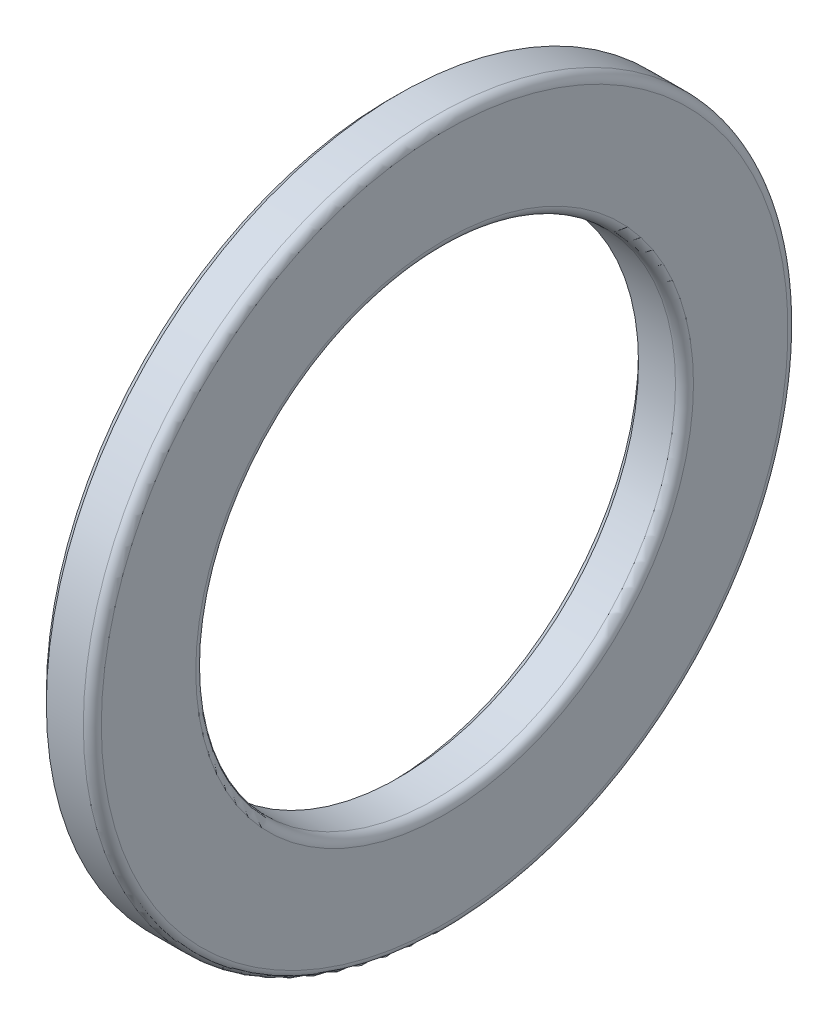
ISO-10303-21;
HEADER;
FILE_DESCRIPTION(('STEP AP214'),'2;1');
FILE_NAME('part.step','',(''),(''),'','','');
FILE_SCHEMA(('AUTOMOTIVE_DESIGN { 1 0 10303 214 1 1 1 1 }'));
ENDSEC;
DATA;
#1=APPLICATION_CONTEXT('core data for automotive mechanical design processes');
#2=APPLICATION_PROTOCOL_DEFINITION('international standard','automotive_design',2000,#1);
#3=PRODUCT_CONTEXT('',#1,'mechanical');
#4=PRODUCT('Part','Part','',(#3));
#5=PRODUCT_RELATED_PRODUCT_CATEGORY('part','',(#4));
#6=PRODUCT_DEFINITION_FORMATION('','',#4);
#7=PRODUCT_DEFINITION_CONTEXT('part definition',#1,'design');
#8=PRODUCT_DEFINITION('design','',#6,#7);
#9=PRODUCT_DEFINITION_SHAPE('','',#8);
#10=(LENGTH_UNIT() NAMED_UNIT(*) SI_UNIT(.MILLI.,.METRE.));
#11=(NAMED_UNIT(*) PLANE_ANGLE_UNIT() SI_UNIT($,.RADIAN.));
#12=(NAMED_UNIT(*) SI_UNIT($,.STERADIAN.) SOLID_ANGLE_UNIT());
#13=UNCERTAINTY_MEASURE_WITH_UNIT(LENGTH_MEASURE(1.E-05),#10,'distance_accuracy_value','');
#14=(GEOMETRIC_REPRESENTATION_CONTEXT(3) GLOBAL_UNCERTAINTY_ASSIGNED_CONTEXT((#13)) GLOBAL_UNIT_ASSIGNED_CONTEXT((#10,
#11,#12)) REPRESENTATION_CONTEXT('',''));
#15=CARTESIAN_POINT('',(0.,0.,0.));
#16=DIRECTION('',(0.,0.,1.));
#17=DIRECTION('',(1.,0.,0.));
#18=AXIS2_PLACEMENT_3D('',#15,#16,#17);
#19=CARTESIAN_POINT('',(7.33333333333333,0.,0.));
#20=DIRECTION('',(-1.,0.,0.));
#21=DIRECTION('',(0.,0.,1.));
#22=AXIS2_PLACEMENT_3D('',#19,#20,#21);
#23=CONICAL_SURFACE('',#22,16.6,0.785398163397448);
#24=CARTESIAN_POINT('',(7.93333333333333,0.,0.));
#25=DIRECTION('',(-1.,0.,0.));
#26=DIRECTION('',(0.,0.,1.));
#27=AXIS2_PLACEMENT_3D('',#24,#25,#26);
#28=CIRCLE('',#27,16.);
#29=CARTESIAN_POINT('',(7.93333333333333,0.,16.));
#30=VERTEX_POINT('',#29);
#31=EDGE_CURVE('E10',#30,#30,#28,.T.);
#32=ORIENTED_EDGE('',*,*,#31,.F.);
#33=EDGE_LOOP('',(#32));
#34=FACE_BOUND('',#33,.T.);
#35=CARTESIAN_POINT('',(7.33333333333333,0.,0.));
#36=DIRECTION('',(-1.,0.,0.));
#37=DIRECTION('',(0.,0.,1.));
#38=AXIS2_PLACEMENT_3D('',#35,#36,#37);
#39=CIRCLE('',#38,16.6);
#40=CARTESIAN_POINT('',(7.33333333333333,0.,16.6));
#41=VERTEX_POINT('',#40);
#42=EDGE_CURVE('E64',#41,#41,#39,.T.);
#43=ORIENTED_EDGE('',*,*,#42,.T.);
#44=EDGE_LOOP('',(#43));
#45=FACE_BOUND('',#44,.T.);
#46=ADVANCED_FACE('F14',(#34,#45),#23,.F.);
#47=CARTESIAN_POINT('',(0.,0.,0.));
#48=DIRECTION('',(-1.,0.,0.));
#49=DIRECTION('',(0.,0.,1.));
#50=AXIS2_PLACEMENT_3D('',#47,#48,#49);
#51=CYLINDRICAL_SURFACE('',#50,16.);
#52=CARTESIAN_POINT('',(10.4,0.,0.));
#53=DIRECTION('',(-1.,0.,0.));
#54=DIRECTION('',(0.,0.,1.));
#55=AXIS2_PLACEMENT_3D('',#52,#53,#54);
#56=CIRCLE('',#55,16.);
#57=CARTESIAN_POINT('',(10.4,0.,16.));
#58=VERTEX_POINT('',#57);
#59=EDGE_CURVE('E21',#58,#58,#56,.T.);
#60=ORIENTED_EDGE('',*,*,#59,.F.);
#61=EDGE_LOOP('',(#60));
#62=FACE_BOUND('',#61,.T.);
#63=ORIENTED_EDGE('',*,*,#31,.T.);
#64=EDGE_LOOP('',(#63));
#65=FACE_BOUND('',#64,.T.);
#66=ADVANCED_FACE('F89',(#62,#65),#51,.F.);
#67=CARTESIAN_POINT('',(10.4,0.,0.));
#68=DIRECTION('',(-1.,0.,0.));
#69=DIRECTION('',(0.,0.,1.));
#70=AXIS2_PLACEMENT_3D('',#67,#68,#69);
#71=TOROIDAL_SURFACE('',#70,16.6,0.6);
#72=CARTESIAN_POINT('',(11.,0.,0.));
#73=DIRECTION('',(-1.,0.,0.));
#74=DIRECTION('',(0.,0.,1.));
#75=AXIS2_PLACEMENT_3D('',#72,#73,#74);
#76=CIRCLE('',#75,16.6);
#77=CARTESIAN_POINT('',(11.,0.,16.6));
#78=VERTEX_POINT('',#77);
#79=EDGE_CURVE('E30',#78,#78,#76,.T.);
#80=ORIENTED_EDGE('',*,*,#79,.F.);
#81=EDGE_LOOP('',(#80));
#82=FACE_BOUND('',#81,.T.);
#83=ORIENTED_EDGE('',*,*,#59,.T.);
#84=EDGE_LOOP('',(#83));
#85=FACE_BOUND('',#84,.T.);
#86=ADVANCED_FACE('F94',(#82,#85),#71,.T.);
#87=CARTESIAN_POINT('',(11.,16.6,0.));
#88=DIRECTION('',(-1.,0.,0.));
#89=DIRECTION('',(0.,0.,1.));
#90=AXIS2_PLACEMENT_3D('',#87,#88,#89);
#91=PLANE('',#90);
#92=CARTESIAN_POINT('',(11.,0.,0.));
#93=DIRECTION('',(-1.,0.,0.));
#94=DIRECTION('',(0.,0.,1.));
#95=AXIS2_PLACEMENT_3D('',#92,#93,#94);
#96=CIRCLE('',#95,22.9);
#97=CARTESIAN_POINT('',(11.,0.,22.9));
#98=VERTEX_POINT('',#97);
#99=EDGE_CURVE('E38',#98,#98,#96,.T.);
#100=ORIENTED_EDGE('',*,*,#99,.F.);
#101=EDGE_LOOP('',(#100));
#102=FACE_BOUND('',#101,.T.);
#103=ORIENTED_EDGE('',*,*,#79,.T.);
#104=EDGE_LOOP('',(#103));
#105=FACE_BOUND('',#104,.T.);
#106=ADVANCED_FACE('F99',(#102,#105),#91,.F.);
#107=CARTESIAN_POINT('',(10.4,0.,0.));
#108=DIRECTION('',(-1.,0.,0.));
#109=DIRECTION('',(0.,0.,1.));
#110=AXIS2_PLACEMENT_3D('',#107,#108,#109);
#111=TOROIDAL_SURFACE('',#110,22.9,0.6);
#112=CARTESIAN_POINT('',(10.4,0.,0.));
#113=DIRECTION('',(-1.,0.,0.));
#114=DIRECTION('',(0.,0.,1.));
#115=AXIS2_PLACEMENT_3D('',#112,#113,#114);
#116=CIRCLE('',#115,23.5);
#117=CARTESIAN_POINT('',(10.4,0.,23.5));
#118=VERTEX_POINT('',#117);
#119=EDGE_CURVE('E44',#118,#118,#116,.T.);
#120=ORIENTED_EDGE('',*,*,#119,.F.);
#121=EDGE_LOOP('',(#120));
#122=FACE_BOUND('',#121,.T.);
#123=ORIENTED_EDGE('',*,*,#99,.T.);
#124=EDGE_LOOP('',(#123));
#125=FACE_BOUND('',#124,.T.);
#126=ADVANCED_FACE('F105',(#122,#125),#111,.T.);
#127=CARTESIAN_POINT('',(0.,0.,0.));
#128=DIRECTION('',(-1.,0.,0.));
#129=DIRECTION('',(0.,0.,1.));
#130=AXIS2_PLACEMENT_3D('',#127,#128,#129);
#131=CYLINDRICAL_SURFACE('',#130,23.5);
#132=CARTESIAN_POINT('',(7.93333333333333,0.,0.));
#133=DIRECTION('',(-1.,0.,0.));
#134=DIRECTION('',(0.,0.,1.));
#135=AXIS2_PLACEMENT_3D('',#132,#133,#134);
#136=CIRCLE('',#135,23.5);
#137=CARTESIAN_POINT('',(7.93333333333333,0.,23.5));
#138=VERTEX_POINT('',#137);
#139=EDGE_CURVE('E48',#138,#138,#136,.T.);
#140=ORIENTED_EDGE('',*,*,#139,.F.);
#141=EDGE_LOOP('',(#140));
#142=FACE_BOUND('',#141,.T.);
#143=ORIENTED_EDGE('',*,*,#119,.T.);
#144=EDGE_LOOP('',(#143));
#145=FACE_BOUND('',#144,.T.);
#146=ADVANCED_FACE('F109',(#142,#145),#131,.T.);
#147=CARTESIAN_POINT('',(7.93333333333333,0.,0.));
#148=DIRECTION('',(1.,0.,0.));
#149=DIRECTION('',(0.,0.,-1.));
#150=AXIS2_PLACEMENT_3D('',#147,#148,#149);
#151=CONICAL_SURFACE('',#150,23.5,0.785398163397448);
#152=CARTESIAN_POINT('',(7.33333333333333,0.,0.));
#153=DIRECTION('',(-1.,0.,0.));
#154=DIRECTION('',(0.,0.,1.));
#155=AXIS2_PLACEMENT_3D('',#152,#153,#154);
#156=CIRCLE('',#155,22.9);
#157=CARTESIAN_POINT('',(7.33333333333333,0.,22.9));
#158=VERTEX_POINT('',#157);
#159=EDGE_CURVE('E52',#158,#158,#156,.T.);
#160=ORIENTED_EDGE('',*,*,#159,.F.);
#161=EDGE_LOOP('',(#160));
#162=FACE_BOUND('',#161,.T.);
#163=ORIENTED_EDGE('',*,*,#139,.T.);
#164=EDGE_LOOP('',(#163));
#165=FACE_BOUND('',#164,.T.);
#166=ADVANCED_FACE('F85',(#162,#165),#151,.T.);
#167=CARTESIAN_POINT('',(7.33333333333333,22.9,0.));
#168=DIRECTION('',(1.,0.,0.));
#169=DIRECTION('',(0.,0.,-1.));
#170=AXIS2_PLACEMENT_3D('',#167,#168,#169);
#171=PLANE('',#170);
#172=CARTESIAN_POINT('',(7.33333333333333,0.,0.));
#173=DIRECTION('',(-1.,0.,0.));
#174=DIRECTION('',(0.,0.,1.));
#175=AXIS2_PLACEMENT_3D('',#172,#173,#174);
#176=CIRCLE('',#175,21.2997289793748);
#177=CARTESIAN_POINT('',(7.33333333333333,0.,21.2997289793748));
#178=VERTEX_POINT('',#177);
#179=EDGE_CURVE('E56',#178,#178,#176,.T.);
#180=ORIENTED_EDGE('',*,*,#179,.F.);
#181=EDGE_LOOP('',(#180));
#182=FACE_BOUND('',#181,.T.);
#183=ORIENTED_EDGE('',*,*,#159,.T.);
#184=EDGE_LOOP('',(#183));
#185=FACE_BOUND('',#184,.T.);
#186=ADVANCED_FACE('F78',(#182,#185),#171,.F.);
#187=CARTESIAN_POINT('',(5.5,0.,0.));
#188=DIRECTION('',(-1.,0.,0.));
#189=DIRECTION('',(0.,0.,1.));
#190=AXIS2_PLACEMENT_3D('',#187,#188,#189);
#191=TOROIDAL_SURFACE('',#190,19.25,2.75);
#192=ORIENTED_EDGE('',*,*,#179,.T.);
#193=EDGE_LOOP('',(#192));
#194=FACE_BOUND('',#193,.T.);
#195=CARTESIAN_POINT('',(7.33333333333333,0.,0.));
#196=DIRECTION('',(-1.,0.,0.));
#197=DIRECTION('',(0.,0.,1.));
#198=AXIS2_PLACEMENT_3D('',#195,#196,#197);
#199=CIRCLE('',#198,17.2002710206252);
#200=CARTESIAN_POINT('',(7.33333333333333,0.,17.2002710206252));
#201=VERTEX_POINT('',#200);
#202=EDGE_CURVE('E60',#201,#201,#199,.T.);
#203=ORIENTED_EDGE('',*,*,#202,.F.);
#204=EDGE_LOOP('',(#203));
#205=FACE_BOUND('',#204,.T.);
#206=ADVANCED_FACE('F73',(#194,#205),#191,.F.);
#207=CARTESIAN_POINT('',(7.33333333333333,17.2002710206252,0.));
#208=DIRECTION('',(1.,0.,0.));
#209=DIRECTION('',(0.,0.,-1.));
#210=AXIS2_PLACEMENT_3D('',#207,#208,#209);
#211=PLANE('',#210);
#212=ORIENTED_EDGE('',*,*,#42,.F.);
#213=EDGE_LOOP('',(#212));
#214=FACE_BOUND('',#213,.T.);
#215=ORIENTED_EDGE('',*,*,#202,.T.);
#216=EDGE_LOOP('',(#215));
#217=FACE_BOUND('',#216,.T.);
#218=ADVANCED_FACE('F70',(#214,#217),#211,.F.);
#219=CLOSED_SHELL('',(#46,#66,#86,#106,#126,#146,#166,#186,#206,#218));
#220=MANIFOLD_SOLID_BREP('B1',#219);
#221=ADVANCED_BREP_SHAPE_REPRESENTATION('',(#18,#220),#14);
#222=SHAPE_DEFINITION_REPRESENTATION(#9,#221);
ENDSEC;
END-ISO-10303-21;
